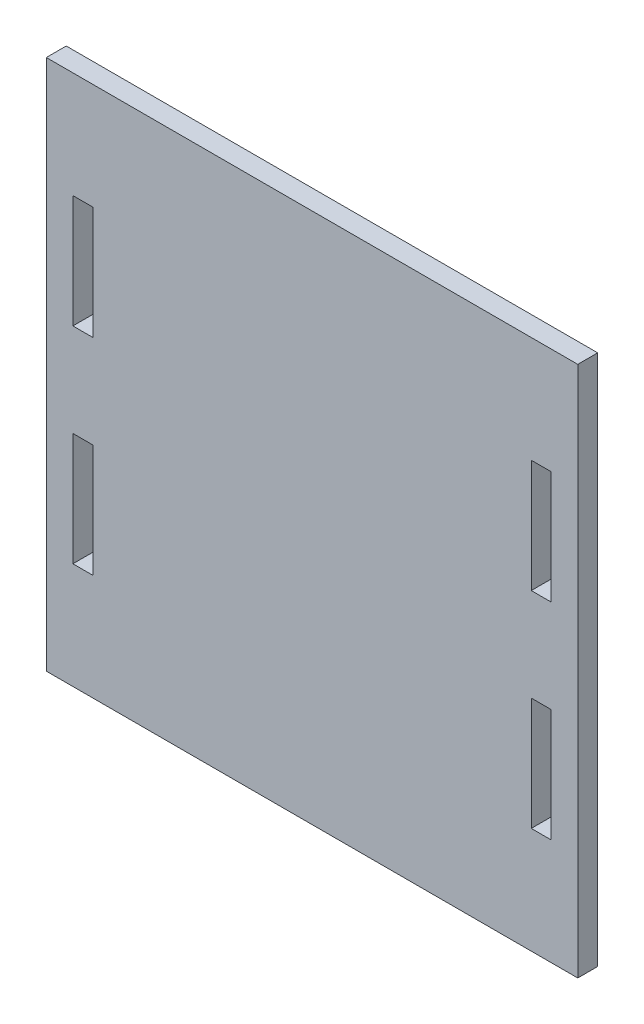
ISO-10303-21;
HEADER;
FILE_DESCRIPTION(('STEP AP214'),'2;1');
FILE_NAME('part.step','',(''),(''),'','','');
FILE_SCHEMA(('AUTOMOTIVE_DESIGN { 1 0 10303 214 1 1 1 1 }'));
ENDSEC;
DATA;
#1=APPLICATION_CONTEXT('core data for automotive mechanical design processes');
#2=APPLICATION_PROTOCOL_DEFINITION('international standard','automotive_design',2000,#1);
#3=PRODUCT_CONTEXT('',#1,'mechanical');
#4=PRODUCT('Part','Part','',(#3));
#5=PRODUCT_RELATED_PRODUCT_CATEGORY('part','',(#4));
#6=PRODUCT_DEFINITION_FORMATION('','',#4);
#7=PRODUCT_DEFINITION_CONTEXT('part definition',#1,'design');
#8=PRODUCT_DEFINITION('design','',#6,#7);
#9=PRODUCT_DEFINITION_SHAPE('','',#8);
#10=(LENGTH_UNIT() NAMED_UNIT(*) SI_UNIT(.MILLI.,.METRE.));
#11=(NAMED_UNIT(*) PLANE_ANGLE_UNIT() SI_UNIT($,.RADIAN.));
#12=(NAMED_UNIT(*) SI_UNIT($,.STERADIAN.) SOLID_ANGLE_UNIT());
#13=UNCERTAINTY_MEASURE_WITH_UNIT(LENGTH_MEASURE(1.E-05),#10,'distance_accuracy_value','');
#14=(GEOMETRIC_REPRESENTATION_CONTEXT(3) GLOBAL_UNCERTAINTY_ASSIGNED_CONTEXT((#13)) GLOBAL_UNIT_ASSIGNED_CONTEXT((#10,
#11,#12)) REPRESENTATION_CONTEXT('',''));
#15=CARTESIAN_POINT('',(0.,0.,0.));
#16=DIRECTION('',(0.,0.,1.));
#17=DIRECTION('',(1.,0.,0.));
#18=AXIS2_PLACEMENT_3D('',#15,#16,#17);
#19=CARTESIAN_POINT('',(0.,0.,4.7625));
#20=DIRECTION('',(0.,0.,-1.));
#21=DIRECTION('',(-1.,0.,0.));
#22=AXIS2_PLACEMENT_3D('',#19,#20,#21);
#23=PLANE('',#22);
#24=DIRECTION('',(0.,1.,0.));
#25=VECTOR('',#24,1.);
#26=CARTESIAN_POINT('',(120.65,40.9157375363102,4.7625));
#27=LINE('',#26,#25);
#28=CARTESIAN_POINT('',(120.65,40.9157375363102,4.7625));
#29=VERTEX_POINT('',#28);
#30=CARTESIAN_POINT('',(120.65,67.8905384245548,4.7625));
#31=VERTEX_POINT('',#30);
#32=EDGE_CURVE('E206',#29,#31,#27,.T.);
#33=ORIENTED_EDGE('',*,*,#32,.F.);
#34=DIRECTION('',(1.,0.,0.));
#35=VECTOR('',#34,1.);
#36=CARTESIAN_POINT('',(120.65,40.9157375363102,4.7625));
#37=LINE('',#36,#35);
#38=CARTESIAN_POINT('',(115.8875,40.9157375363102,4.7625));
#39=VERTEX_POINT('',#38);
#40=EDGE_CURVE('E214',#39,#29,#37,.T.);
#41=ORIENTED_EDGE('',*,*,#40,.F.);
#42=DIRECTION('',(0.,-1.,0.));
#43=VECTOR('',#42,1.);
#44=CARTESIAN_POINT('',(115.8875,40.9157375363102,4.7625));
#45=LINE('',#44,#43);
#46=CARTESIAN_POINT('',(115.8875,67.8905384245548,4.7625));
#47=VERTEX_POINT('',#46);
#48=EDGE_CURVE('E211',#47,#39,#45,.T.);
#49=ORIENTED_EDGE('',*,*,#48,.F.);
#50=DIRECTION('',(-1.,0.,0.));
#51=VECTOR('',#50,1.);
#52=CARTESIAN_POINT('',(120.65,67.8905384245548,4.7625));
#53=LINE('',#52,#51);
#54=EDGE_CURVE('E208',#31,#47,#53,.T.);
#55=ORIENTED_EDGE('',*,*,#54,.F.);
#56=EDGE_LOOP('',(#33,#41,#49,#55));
#57=FACE_BOUND('',#56,.T.);
#58=DIRECTION('',(0.,-1.,0.));
#59=VECTOR('',#58,1.);
#60=CARTESIAN_POINT('',(6.35000000000001,117.11573753631,4.7625));
#61=LINE('',#60,#59);
#62=CARTESIAN_POINT('',(6.35000000000001,117.11573753631,4.7625));
#63=VERTEX_POINT('',#62);
#64=CARTESIAN_POINT('',(6.35000000000001,90.1409366480657,4.7625));
#65=VERTEX_POINT('',#64);
#66=EDGE_CURVE('E268',#63,#65,#61,.T.);
#67=ORIENTED_EDGE('',*,*,#66,.F.);
#68=DIRECTION('',(-1.,0.,0.));
#69=VECTOR('',#68,1.);
#70=CARTESIAN_POINT('',(6.35000000000001,117.11573753631,4.7625));
#71=LINE('',#70,#69);
#72=CARTESIAN_POINT('',(11.1125,117.11573753631,4.7625));
#73=VERTEX_POINT('',#72);
#74=EDGE_CURVE('E276',#73,#63,#71,.T.);
#75=ORIENTED_EDGE('',*,*,#74,.F.);
#76=DIRECTION('',(0.,1.,0.));
#77=VECTOR('',#76,1.);
#78=CARTESIAN_POINT('',(11.1125,117.11573753631,4.7625));
#79=LINE('',#78,#77);
#80=CARTESIAN_POINT('',(11.1125,90.1409366480657,4.7625));
#81=VERTEX_POINT('',#80);
#82=EDGE_CURVE('E273',#81,#73,#79,.T.);
#83=ORIENTED_EDGE('',*,*,#82,.F.);
#84=DIRECTION('',(1.,0.,0.));
#85=VECTOR('',#84,1.);
#86=CARTESIAN_POINT('',(6.35000000000001,90.1409366480657,4.7625));
#87=LINE('',#86,#85);
#88=EDGE_CURVE('E270',#65,#81,#87,.T.);
#89=ORIENTED_EDGE('',*,*,#88,.F.);
#90=EDGE_LOOP('',(#67,#75,#83,#89));
#91=FACE_BOUND('',#90,.T.);
#92=DIRECTION('',(0.,-1.,0.));
#93=VECTOR('',#92,1.);
#94=CARTESIAN_POINT('',(0.,15.5157375363102,4.7625));
#95=LINE('',#94,#93);
#96=CARTESIAN_POINT('',(0.,142.51573753631,4.7625));
#97=VERTEX_POINT('',#96);
#98=CARTESIAN_POINT('',(0.,15.5157375363102,4.7625));
#99=VERTEX_POINT('',#98);
#100=EDGE_CURVE('E299',#97,#99,#95,.T.);
#101=ORIENTED_EDGE('',*,*,#100,.T.);
#102=DIRECTION('',(1.,0.,0.));
#103=VECTOR('',#102,1.);
#104=CARTESIAN_POINT('',(0.,15.5157375363102,4.7625));
#105=LINE('',#104,#103);
#106=CARTESIAN_POINT('',(127.,15.5157375363102,4.7625));
#107=VERTEX_POINT('',#106);
#108=EDGE_CURVE('E302',#99,#107,#105,.T.);
#109=ORIENTED_EDGE('',*,*,#108,.T.);
#110=DIRECTION('',(0.,1.,0.));
#111=VECTOR('',#110,1.);
#112=CARTESIAN_POINT('',(127.,15.5157375363102,4.7625));
#113=LINE('',#112,#111);
#114=CARTESIAN_POINT('',(127.,142.51573753631,4.7625));
#115=VERTEX_POINT('',#114);
#116=EDGE_CURVE('E305',#107,#115,#113,.T.);
#117=ORIENTED_EDGE('',*,*,#116,.T.);
#118=DIRECTION('',(-1.,0.,0.));
#119=VECTOR('',#118,1.);
#120=CARTESIAN_POINT('',(65.88125,142.51573753631,4.7625));
#121=LINE('',#120,#119);
#122=EDGE_CURVE('E307',#115,#97,#121,.T.);
#123=ORIENTED_EDGE('',*,*,#122,.T.);
#124=EDGE_LOOP('',(#101,#109,#117,#123));
#125=FACE_BOUND('',#124,.T.);
#126=DIRECTION('',(-1.,0.,0.));
#127=VECTOR('',#126,1.);
#128=CARTESIAN_POINT('',(120.65,117.11573753631,4.7625));
#129=LINE('',#128,#127);
#130=CARTESIAN_POINT('',(120.65,117.11573753631,4.7625));
#131=VERTEX_POINT('',#130);
#132=CARTESIAN_POINT('',(115.8875,117.11573753631,4.7625));
#133=VERTEX_POINT('',#132);
#134=EDGE_CURVE('E237',#131,#133,#129,.T.);
#135=ORIENTED_EDGE('',*,*,#134,.F.);
#136=DIRECTION('',(0.,1.,0.));
#137=VECTOR('',#136,1.);
#138=CARTESIAN_POINT('',(120.65,117.11573753631,4.7625));
#139=LINE('',#138,#137);
#140=CARTESIAN_POINT('',(120.65,90.1409366480657,4.7625));
#141=VERTEX_POINT('',#140);
#142=EDGE_CURVE('E245',#141,#131,#139,.T.);
#143=ORIENTED_EDGE('',*,*,#142,.F.);
#144=DIRECTION('',(1.,0.,0.));
#145=VECTOR('',#144,1.);
#146=CARTESIAN_POINT('',(120.65,90.1409366480657,4.7625));
#147=LINE('',#146,#145);
#148=CARTESIAN_POINT('',(115.8875,90.1409366480657,4.7625));
#149=VERTEX_POINT('',#148);
#150=EDGE_CURVE('E242',#149,#141,#147,.T.);
#151=ORIENTED_EDGE('',*,*,#150,.F.);
#152=DIRECTION('',(0.,-1.,0.));
#153=VECTOR('',#152,1.);
#154=CARTESIAN_POINT('',(115.8875,117.11573753631,4.7625));
#155=LINE('',#154,#153);
#156=EDGE_CURVE('E239',#133,#149,#155,.T.);
#157=ORIENTED_EDGE('',*,*,#156,.F.);
#158=EDGE_LOOP('',(#135,#143,#151,#157));
#159=FACE_BOUND('',#158,.T.);
#160=DIRECTION('',(1.,0.,0.));
#161=VECTOR('',#160,1.);
#162=CARTESIAN_POINT('',(6.35000000000001,40.9157375363102,4.7625));
#163=LINE('',#162,#161);
#164=CARTESIAN_POINT('',(6.35000000000001,40.9157375363102,4.7625));
#165=VERTEX_POINT('',#164);
#166=CARTESIAN_POINT('',(11.1125,40.9157375363102,4.7625));
#167=VERTEX_POINT('',#166);
#168=EDGE_CURVE('E170',#165,#167,#163,.T.);
#169=ORIENTED_EDGE('',*,*,#168,.F.);
#170=DIRECTION('',(0.,-1.,0.));
#171=VECTOR('',#170,1.);
#172=CARTESIAN_POINT('',(6.35000000000001,40.9157375363102,4.7625));
#173=LINE('',#172,#171);
#174=CARTESIAN_POINT('',(6.35000000000001,67.8905384245548,4.7625));
#175=VERTEX_POINT('',#174);
#176=EDGE_CURVE('E192',#175,#165,#173,.T.);
#177=ORIENTED_EDGE('',*,*,#176,.F.);
#178=DIRECTION('',(-1.,0.,0.));
#179=VECTOR('',#178,1.);
#180=CARTESIAN_POINT('',(6.35000000000001,67.8905384245548,4.7625));
#181=LINE('',#180,#179);
#182=CARTESIAN_POINT('',(11.1125,67.8905384245548,4.7625));
#183=VERTEX_POINT('',#182);
#184=EDGE_CURVE('E190',#183,#175,#181,.T.);
#185=ORIENTED_EDGE('',*,*,#184,.F.);
#186=DIRECTION('',(0.,1.,0.));
#187=VECTOR('',#186,1.);
#188=CARTESIAN_POINT('',(11.1125,40.9157375363102,4.7625));
#189=LINE('',#188,#187);
#190=EDGE_CURVE('E178',#167,#183,#189,.T.);
#191=ORIENTED_EDGE('',*,*,#190,.F.);
#192=EDGE_LOOP('',(#169,#177,#185,#191));
#193=FACE_BOUND('',#192,.T.);
#194=ADVANCED_FACE('F33',(#57,#91,#125,#159,#193),#23,.F.);
#195=CARTESIAN_POINT('',(0.,0.,0.));
#196=DIRECTION('',(0.,0.,-1.));
#197=DIRECTION('',(-1.,0.,0.));
#198=AXIS2_PLACEMENT_3D('',#195,#196,#197);
#199=PLANE('',#198);
#200=DIRECTION('',(1.,0.,0.));
#201=VECTOR('',#200,1.);
#202=CARTESIAN_POINT('',(120.65,40.9157375363102,0.));
#203=LINE('',#202,#201);
#204=CARTESIAN_POINT('',(115.8875,40.9157375363102,0.));
#205=VERTEX_POINT('',#204);
#206=CARTESIAN_POINT('',(120.65,40.9157375363102,0.));
#207=VERTEX_POINT('',#206);
#208=EDGE_CURVE('E209',#205,#207,#203,.T.);
#209=ORIENTED_EDGE('',*,*,#208,.T.);
#210=DIRECTION('',(0.,1.,0.));
#211=VECTOR('',#210,1.);
#212=CARTESIAN_POINT('',(120.65,40.9157375363102,0.));
#213=LINE('',#212,#211);
#214=CARTESIAN_POINT('',(120.65,67.8905384245548,0.));
#215=VERTEX_POINT('',#214);
#216=EDGE_CURVE('E186',#207,#215,#213,.T.);
#217=ORIENTED_EDGE('',*,*,#216,.T.);
#218=DIRECTION('',(-1.,0.,0.));
#219=VECTOR('',#218,1.);
#220=CARTESIAN_POINT('',(120.65,67.8905384245548,0.));
#221=LINE('',#220,#219);
#222=CARTESIAN_POINT('',(115.8875,67.8905384245548,0.));
#223=VERTEX_POINT('',#222);
#224=EDGE_CURVE('E219',#215,#223,#221,.T.);
#225=ORIENTED_EDGE('',*,*,#224,.T.);
#226=DIRECTION('',(0.,-1.,0.));
#227=VECTOR('',#226,1.);
#228=CARTESIAN_POINT('',(115.8875,40.9157375363102,0.));
#229=LINE('',#228,#227);
#230=EDGE_CURVE('E222',#223,#205,#229,.T.);
#231=ORIENTED_EDGE('',*,*,#230,.T.);
#232=EDGE_LOOP('',(#209,#217,#225,#231));
#233=FACE_BOUND('',#232,.T.);
#234=DIRECTION('',(-1.,0.,0.));
#235=VECTOR('',#234,1.);
#236=CARTESIAN_POINT('',(6.35000000000001,117.11573753631,0.));
#237=LINE('',#236,#235);
#238=CARTESIAN_POINT('',(11.1125,117.11573753631,0.));
#239=VERTEX_POINT('',#238);
#240=CARTESIAN_POINT('',(6.35000000000001,117.11573753631,0.));
#241=VERTEX_POINT('',#240);
#242=EDGE_CURVE('E271',#239,#241,#237,.T.);
#243=ORIENTED_EDGE('',*,*,#242,.T.);
#244=DIRECTION('',(0.,-1.,0.));
#245=VECTOR('',#244,1.);
#246=CARTESIAN_POINT('',(6.35000000000001,117.11573753631,0.));
#247=LINE('',#246,#245);
#248=CARTESIAN_POINT('',(6.35000000000001,90.1409366480657,0.));
#249=VERTEX_POINT('',#248);
#250=EDGE_CURVE('E267',#241,#249,#247,.T.);
#251=ORIENTED_EDGE('',*,*,#250,.T.);
#252=DIRECTION('',(1.,0.,0.));
#253=VECTOR('',#252,1.);
#254=CARTESIAN_POINT('',(6.35000000000001,90.1409366480657,0.));
#255=LINE('',#254,#253);
#256=CARTESIAN_POINT('',(11.1125,90.1409366480657,0.));
#257=VERTEX_POINT('',#256);
#258=EDGE_CURVE('E281',#249,#257,#255,.T.);
#259=ORIENTED_EDGE('',*,*,#258,.T.);
#260=DIRECTION('',(0.,1.,0.));
#261=VECTOR('',#260,1.);
#262=CARTESIAN_POINT('',(11.1125,117.11573753631,0.));
#263=LINE('',#262,#261);
#264=EDGE_CURVE('E284',#257,#239,#263,.T.);
#265=ORIENTED_EDGE('',*,*,#264,.T.);
#266=EDGE_LOOP('',(#243,#251,#259,#265));
#267=FACE_BOUND('',#266,.T.);
#268=DIRECTION('',(0.,-1.,0.));
#269=VECTOR('',#268,1.);
#270=CARTESIAN_POINT('',(0.,15.5157375363102,0.));
#271=LINE('',#270,#269);
#272=CARTESIAN_POINT('',(0.,142.51573753631,0.));
#273=VERTEX_POINT('',#272);
#274=CARTESIAN_POINT('',(0.,15.5157375363102,0.));
#275=VERTEX_POINT('',#274);
#276=EDGE_CURVE('E298',#273,#275,#271,.T.);
#277=ORIENTED_EDGE('',*,*,#276,.F.);
#278=DIRECTION('',(-1.,0.,0.));
#279=VECTOR('',#278,1.);
#280=CARTESIAN_POINT('',(0.,142.51573753631,0.));
#281=LINE('',#280,#279);
#282=CARTESIAN_POINT('',(127.,142.51573753631,0.));
#283=VERTEX_POINT('',#282);
#284=EDGE_CURVE('E303',#283,#273,#281,.T.);
#285=ORIENTED_EDGE('',*,*,#284,.F.);
#286=DIRECTION('',(0.,1.,0.));
#287=VECTOR('',#286,1.);
#288=CARTESIAN_POINT('',(127.,15.5157375363102,0.));
#289=LINE('',#288,#287);
#290=CARTESIAN_POINT('',(127.,15.5157375363102,0.));
#291=VERTEX_POINT('',#290);
#292=EDGE_CURVE('E314',#291,#283,#289,.T.);
#293=ORIENTED_EDGE('',*,*,#292,.F.);
#294=DIRECTION('',(1.,0.,0.));
#295=VECTOR('',#294,1.);
#296=CARTESIAN_POINT('',(0.,15.5157375363102,0.));
#297=LINE('',#296,#295);
#298=EDGE_CURVE('E312',#275,#291,#297,.T.);
#299=ORIENTED_EDGE('',*,*,#298,.F.);
#300=EDGE_LOOP('',(#277,#285,#293,#299));
#301=FACE_BOUND('',#300,.T.);
#302=DIRECTION('',(0.,1.,0.));
#303=VECTOR('',#302,1.);
#304=CARTESIAN_POINT('',(120.65,117.11573753631,0.));
#305=LINE('',#304,#303);
#306=CARTESIAN_POINT('',(120.65,90.1409366480657,0.));
#307=VERTEX_POINT('',#306);
#308=CARTESIAN_POINT('',(120.65,117.11573753631,0.));
#309=VERTEX_POINT('',#308);
#310=EDGE_CURVE('E240',#307,#309,#305,.T.);
#311=ORIENTED_EDGE('',*,*,#310,.T.);
#312=DIRECTION('',(-1.,0.,0.));
#313=VECTOR('',#312,1.);
#314=CARTESIAN_POINT('',(120.65,117.11573753631,0.));
#315=LINE('',#314,#313);
#316=CARTESIAN_POINT('',(115.8875,117.11573753631,0.));
#317=VERTEX_POINT('',#316);
#318=EDGE_CURVE('E236',#309,#317,#315,.T.);
#319=ORIENTED_EDGE('',*,*,#318,.T.);
#320=DIRECTION('',(0.,-1.,0.));
#321=VECTOR('',#320,1.);
#322=CARTESIAN_POINT('',(115.8875,117.11573753631,0.));
#323=LINE('',#322,#321);
#324=CARTESIAN_POINT('',(115.8875,90.1409366480657,0.));
#325=VERTEX_POINT('',#324);
#326=EDGE_CURVE('E250',#317,#325,#323,.T.);
#327=ORIENTED_EDGE('',*,*,#326,.T.);
#328=DIRECTION('',(1.,0.,0.));
#329=VECTOR('',#328,1.);
#330=CARTESIAN_POINT('',(120.65,90.1409366480657,0.));
#331=LINE('',#330,#329);
#332=EDGE_CURVE('E253',#325,#307,#331,.T.);
#333=ORIENTED_EDGE('',*,*,#332,.T.);
#334=EDGE_LOOP('',(#311,#319,#327,#333));
#335=FACE_BOUND('',#334,.T.);
#336=DIRECTION('',(0.,-1.,0.));
#337=VECTOR('',#336,1.);
#338=CARTESIAN_POINT('',(6.35000000000001,40.9157375363102,0.));
#339=LINE('',#338,#337);
#340=CARTESIAN_POINT('',(6.35000000000001,67.8905384245548,0.));
#341=VERTEX_POINT('',#340);
#342=CARTESIAN_POINT('',(6.35000000000001,40.9157375363102,0.));
#343=VERTEX_POINT('',#342);
#344=EDGE_CURVE('E179',#341,#343,#339,.T.);
#345=ORIENTED_EDGE('',*,*,#344,.T.);
#346=DIRECTION('',(1.,0.,0.));
#347=VECTOR('',#346,1.);
#348=CARTESIAN_POINT('',(6.35000000000001,40.9157375363102,0.));
#349=LINE('',#348,#347);
#350=CARTESIAN_POINT('',(11.1125,40.9157375363102,0.));
#351=VERTEX_POINT('',#350);
#352=EDGE_CURVE('E56',#343,#351,#349,.T.);
#353=ORIENTED_EDGE('',*,*,#352,.T.);
#354=DIRECTION('',(0.,1.,0.));
#355=VECTOR('',#354,1.);
#356=CARTESIAN_POINT('',(11.1125,40.9157375363102,0.));
#357=LINE('',#356,#355);
#358=CARTESIAN_POINT('',(11.1125,67.8905384245548,0.));
#359=VERTEX_POINT('',#358);
#360=EDGE_CURVE('E185',#351,#359,#357,.T.);
#361=ORIENTED_EDGE('',*,*,#360,.T.);
#362=DIRECTION('',(-1.,0.,0.));
#363=VECTOR('',#362,1.);
#364=CARTESIAN_POINT('',(6.35000000000001,67.8905384245548,0.));
#365=LINE('',#364,#363);
#366=EDGE_CURVE('E198',#359,#341,#365,.T.);
#367=ORIENTED_EDGE('',*,*,#366,.T.);
#368=EDGE_LOOP('',(#345,#353,#361,#367));
#369=FACE_BOUND('',#368,.T.);
#370=ADVANCED_FACE('F332',(#233,#267,#301,#335,#369),#199,.T.);
#371=CARTESIAN_POINT('',(0.,15.5157375363102,4.7625));
#372=DIRECTION('',(1.,0.,0.));
#373=DIRECTION('',(0.,0.,-1.));
#374=AXIS2_PLACEMENT_3D('',#371,#372,#373);
#375=PLANE('',#374);
#376=ORIENTED_EDGE('',*,*,#276,.T.);
#377=DIRECTION('',(0.,0.,-1.));
#378=VECTOR('',#377,1.);
#379=CARTESIAN_POINT('',(0.,15.5157375363102,4.7625));
#380=LINE('',#379,#378);
#381=EDGE_CURVE('E11',#99,#275,#380,.T.);
#382=ORIENTED_EDGE('',*,*,#381,.F.);
#383=ORIENTED_EDGE('',*,*,#100,.F.);
#384=DIRECTION('',(0.,0.,-1.));
#385=VECTOR('',#384,1.);
#386=CARTESIAN_POINT('',(0.,142.51573753631,4.7625));
#387=LINE('',#386,#385);
#388=EDGE_CURVE('E309',#97,#273,#387,.T.);
#389=ORIENTED_EDGE('',*,*,#388,.T.);
#390=EDGE_LOOP('',(#376,#382,#383,#389));
#391=FACE_BOUND('',#390,.T.);
#392=ADVANCED_FACE('F35',(#391),#375,.F.);
#393=CARTESIAN_POINT('',(0.,15.5157375363102,4.7625));
#394=DIRECTION('',(0.,1.,0.));
#395=DIRECTION('',(0.,0.,1.));
#396=AXIS2_PLACEMENT_3D('',#393,#394,#395);
#397=PLANE('',#396);
#398=ORIENTED_EDGE('',*,*,#298,.T.);
#399=DIRECTION('',(0.,0.,-1.));
#400=VECTOR('',#399,1.);
#401=CARTESIAN_POINT('',(127.,15.5157375363102,4.7625));
#402=LINE('',#401,#400);
#403=EDGE_CURVE('E41',#107,#291,#402,.T.);
#404=ORIENTED_EDGE('',*,*,#403,.F.);
#405=ORIENTED_EDGE('',*,*,#108,.F.);
#406=ORIENTED_EDGE('',*,*,#381,.T.);
#407=EDGE_LOOP('',(#398,#404,#405,#406));
#408=FACE_BOUND('',#407,.T.);
#409=ADVANCED_FACE('F343',(#408),#397,.F.);
#410=CARTESIAN_POINT('',(127.,15.5157375363102,4.7625));
#411=DIRECTION('',(-1.,0.,0.));
#412=DIRECTION('',(0.,0.,1.));
#413=AXIS2_PLACEMENT_3D('',#410,#411,#412);
#414=PLANE('',#413);
#415=ORIENTED_EDGE('',*,*,#292,.T.);
#416=DIRECTION('',(0.,0.,-1.));
#417=VECTOR('',#416,1.);
#418=CARTESIAN_POINT('',(127.,142.51573753631,4.7625));
#419=LINE('',#418,#417);
#420=EDGE_CURVE('E320',#115,#283,#419,.T.);
#421=ORIENTED_EDGE('',*,*,#420,.F.);
#422=ORIENTED_EDGE('',*,*,#116,.F.);
#423=ORIENTED_EDGE('',*,*,#403,.T.);
#424=EDGE_LOOP('',(#415,#421,#422,#423));
#425=FACE_BOUND('',#424,.T.);
#426=ADVANCED_FACE('F327',(#425),#414,.F.);
#427=CARTESIAN_POINT('',(0.,142.51573753631,4.7625));
#428=DIRECTION('',(0.,-1.,0.));
#429=DIRECTION('',(0.,0.,-1.));
#430=AXIS2_PLACEMENT_3D('',#427,#428,#429);
#431=PLANE('',#430);
#432=ORIENTED_EDGE('',*,*,#284,.T.);
#433=ORIENTED_EDGE('',*,*,#388,.F.);
#434=ORIENTED_EDGE('',*,*,#122,.F.);
#435=ORIENTED_EDGE('',*,*,#420,.T.);
#436=EDGE_LOOP('',(#432,#433,#434,#435));
#437=FACE_BOUND('',#436,.T.);
#438=ADVANCED_FACE('F336',(#437),#431,.F.);
#439=CARTESIAN_POINT('',(6.35000000000001,117.11573753631,4.7625));
#440=DIRECTION('',(1.,0.,0.));
#441=DIRECTION('',(0.,1.,0.));
#442=AXIS2_PLACEMENT_3D('',#439,#440,#441);
#443=PLANE('',#442);
#444=ORIENTED_EDGE('',*,*,#250,.F.);
#445=DIRECTION('',(0.,0.,-1.));
#446=VECTOR('',#445,1.);
#447=CARTESIAN_POINT('',(6.35000000000001,117.11573753631,4.7625));
#448=LINE('',#447,#446);
#449=EDGE_CURVE('E278',#63,#241,#448,.T.);
#450=ORIENTED_EDGE('',*,*,#449,.F.);
#451=ORIENTED_EDGE('',*,*,#66,.T.);
#452=DIRECTION('',(0.,0.,-1.));
#453=VECTOR('',#452,1.);
#454=CARTESIAN_POINT('',(6.35000000000001,90.1409366480657,4.7625));
#455=LINE('',#454,#453);
#456=EDGE_CURVE('E295',#65,#249,#455,.T.);
#457=ORIENTED_EDGE('',*,*,#456,.T.);
#458=EDGE_LOOP('',(#444,#450,#451,#457));
#459=FACE_BOUND('',#458,.T.);
#460=ADVANCED_FACE('F361',(#459),#443,.T.);
#461=CARTESIAN_POINT('',(6.35000000000001,90.1409366480657,4.7625));
#462=DIRECTION('',(0.,1.,0.));
#463=DIRECTION('',(0.,0.,1.));
#464=AXIS2_PLACEMENT_3D('',#461,#462,#463);
#465=PLANE('',#464);
#466=ORIENTED_EDGE('',*,*,#258,.F.);
#467=ORIENTED_EDGE('',*,*,#456,.F.);
#468=ORIENTED_EDGE('',*,*,#88,.T.);
#469=DIRECTION('',(0.,0.,-1.));
#470=VECTOR('',#469,1.);
#471=CARTESIAN_POINT('',(11.1125,90.1409366480657,4.7625));
#472=LINE('',#471,#470);
#473=EDGE_CURVE('E293',#81,#257,#472,.T.);
#474=ORIENTED_EDGE('',*,*,#473,.T.);
#475=EDGE_LOOP('',(#466,#467,#468,#474));
#476=FACE_BOUND('',#475,.T.);
#477=ADVANCED_FACE('F368',(#476),#465,.T.);
#478=CARTESIAN_POINT('',(11.1125,117.11573753631,4.7625));
#479=DIRECTION('',(-1.,0.,0.));
#480=DIRECTION('',(0.,-1.,0.));
#481=AXIS2_PLACEMENT_3D('',#478,#479,#480);
#482=PLANE('',#481);
#483=ORIENTED_EDGE('',*,*,#264,.F.);
#484=ORIENTED_EDGE('',*,*,#473,.F.);
#485=ORIENTED_EDGE('',*,*,#82,.T.);
#486=DIRECTION('',(0.,0.,-1.));
#487=VECTOR('',#486,1.);
#488=CARTESIAN_POINT('',(11.1125,117.11573753631,4.7625));
#489=LINE('',#488,#487);
#490=EDGE_CURVE('E291',#73,#239,#489,.T.);
#491=ORIENTED_EDGE('',*,*,#490,.T.);
#492=EDGE_LOOP('',(#483,#484,#485,#491));
#493=FACE_BOUND('',#492,.T.);
#494=ADVANCED_FACE('F373',(#493),#482,.T.);
#495=CARTESIAN_POINT('',(6.35000000000001,117.11573753631,4.7625));
#496=DIRECTION('',(0.,-1.,0.));
#497=DIRECTION('',(0.,0.,-1.));
#498=AXIS2_PLACEMENT_3D('',#495,#496,#497);
#499=PLANE('',#498);
#500=ORIENTED_EDGE('',*,*,#242,.F.);
#501=ORIENTED_EDGE('',*,*,#490,.F.);
#502=ORIENTED_EDGE('',*,*,#74,.T.);
#503=ORIENTED_EDGE('',*,*,#449,.T.);
#504=EDGE_LOOP('',(#500,#501,#502,#503));
#505=FACE_BOUND('',#504,.T.);
#506=ADVANCED_FACE('F381',(#505),#499,.T.);
#507=CARTESIAN_POINT('',(120.65,117.11573753631,4.7625));
#508=DIRECTION('',(0.,-1.,0.));
#509=DIRECTION('',(0.,0.,-1.));
#510=AXIS2_PLACEMENT_3D('',#507,#508,#509);
#511=PLANE('',#510);
#512=ORIENTED_EDGE('',*,*,#318,.F.);
#513=DIRECTION('',(0.,0.,-1.));
#514=VECTOR('',#513,1.);
#515=CARTESIAN_POINT('',(120.65,117.11573753631,4.7625));
#516=LINE('',#515,#514);
#517=EDGE_CURVE('E247',#131,#309,#516,.T.);
#518=ORIENTED_EDGE('',*,*,#517,.F.);
#519=ORIENTED_EDGE('',*,*,#134,.T.);
#520=DIRECTION('',(0.,0.,-1.));
#521=VECTOR('',#520,1.);
#522=CARTESIAN_POINT('',(115.8875,117.11573753631,4.7625));
#523=LINE('',#522,#521);
#524=EDGE_CURVE('E264',#133,#317,#523,.T.);
#525=ORIENTED_EDGE('',*,*,#524,.T.);
#526=EDGE_LOOP('',(#512,#518,#519,#525));
#527=FACE_BOUND('',#526,.T.);
#528=ADVANCED_FACE('F393',(#527),#511,.T.);
#529=CARTESIAN_POINT('',(115.8875,117.11573753631,4.7625));
#530=DIRECTION('',(1.,0.,0.));
#531=DIRECTION('',(0.,0.,-1.));
#532=AXIS2_PLACEMENT_3D('',#529,#530,#531);
#533=PLANE('',#532);
#534=ORIENTED_EDGE('',*,*,#326,.F.);
#535=ORIENTED_EDGE('',*,*,#524,.F.);
#536=ORIENTED_EDGE('',*,*,#156,.T.);
#537=DIRECTION('',(0.,0.,-1.));
#538=VECTOR('',#537,1.);
#539=CARTESIAN_POINT('',(115.8875,90.1409366480657,4.7625));
#540=LINE('',#539,#538);
#541=EDGE_CURVE('E262',#149,#325,#540,.T.);
#542=ORIENTED_EDGE('',*,*,#541,.T.);
#543=EDGE_LOOP('',(#534,#535,#536,#542));
#544=FACE_BOUND('',#543,.T.);
#545=ADVANCED_FACE('F398',(#544),#533,.T.);
#546=CARTESIAN_POINT('',(120.65,90.1409366480657,4.7625));
#547=DIRECTION('',(0.,1.,0.));
#548=DIRECTION('',(0.,0.,1.));
#549=AXIS2_PLACEMENT_3D('',#546,#547,#548);
#550=PLANE('',#549);
#551=ORIENTED_EDGE('',*,*,#332,.F.);
#552=ORIENTED_EDGE('',*,*,#541,.F.);
#553=ORIENTED_EDGE('',*,*,#150,.T.);
#554=DIRECTION('',(0.,0.,-1.));
#555=VECTOR('',#554,1.);
#556=CARTESIAN_POINT('',(120.65,90.1409366480657,4.7625));
#557=LINE('',#556,#555);
#558=EDGE_CURVE('E260',#141,#307,#557,.T.);
#559=ORIENTED_EDGE('',*,*,#558,.T.);
#560=EDGE_LOOP('',(#551,#552,#553,#559));
#561=FACE_BOUND('',#560,.T.);
#562=ADVANCED_FACE('F402',(#561),#550,.T.);
#563=CARTESIAN_POINT('',(120.65,117.11573753631,4.7625));
#564=DIRECTION('',(-1.,0.,0.));
#565=DIRECTION('',(0.,0.,1.));
#566=AXIS2_PLACEMENT_3D('',#563,#564,#565);
#567=PLANE('',#566);
#568=ORIENTED_EDGE('',*,*,#310,.F.);
#569=ORIENTED_EDGE('',*,*,#558,.F.);
#570=ORIENTED_EDGE('',*,*,#142,.T.);
#571=ORIENTED_EDGE('',*,*,#517,.T.);
#572=EDGE_LOOP('',(#568,#569,#570,#571));
#573=FACE_BOUND('',#572,.T.);
#574=ADVANCED_FACE('F406',(#573),#567,.T.);
#575=CARTESIAN_POINT('',(120.65,40.9157375363102,4.7625));
#576=DIRECTION('',(-1.,0.,0.));
#577=DIRECTION('',(0.,0.,1.));
#578=AXIS2_PLACEMENT_3D('',#575,#576,#577);
#579=PLANE('',#578);
#580=ORIENTED_EDGE('',*,*,#216,.F.);
#581=DIRECTION('',(0.,0.,-1.));
#582=VECTOR('',#581,1.);
#583=CARTESIAN_POINT('',(120.65,40.9157375363102,4.7625));
#584=LINE('',#583,#582);
#585=EDGE_CURVE('E216',#29,#207,#584,.T.);
#586=ORIENTED_EDGE('',*,*,#585,.F.);
#587=ORIENTED_EDGE('',*,*,#32,.T.);
#588=DIRECTION('',(0.,0.,-1.));
#589=VECTOR('',#588,1.);
#590=CARTESIAN_POINT('',(120.65,67.8905384245548,4.7625));
#591=LINE('',#590,#589);
#592=EDGE_CURVE('E233',#31,#215,#591,.T.);
#593=ORIENTED_EDGE('',*,*,#592,.T.);
#594=EDGE_LOOP('',(#580,#586,#587,#593));
#595=FACE_BOUND('',#594,.T.);
#596=ADVANCED_FACE('F410',(#595),#579,.T.);
#597=CARTESIAN_POINT('',(120.65,67.8905384245548,4.7625));
#598=DIRECTION('',(0.,-1.,0.));
#599=DIRECTION('',(0.,0.,-1.));
#600=AXIS2_PLACEMENT_3D('',#597,#598,#599);
#601=PLANE('',#600);
#602=ORIENTED_EDGE('',*,*,#224,.F.);
#603=ORIENTED_EDGE('',*,*,#592,.F.);
#604=ORIENTED_EDGE('',*,*,#54,.T.);
#605=DIRECTION('',(0.,0.,-1.));
#606=VECTOR('',#605,1.);
#607=CARTESIAN_POINT('',(115.8875,67.8905384245548,4.7625));
#608=LINE('',#607,#606);
#609=EDGE_CURVE('E231',#47,#223,#608,.T.);
#610=ORIENTED_EDGE('',*,*,#609,.T.);
#611=EDGE_LOOP('',(#602,#603,#604,#610));
#612=FACE_BOUND('',#611,.T.);
#613=ADVANCED_FACE('F414',(#612),#601,.T.);
#614=CARTESIAN_POINT('',(115.8875,40.9157375363102,4.7625));
#615=DIRECTION('',(1.,0.,0.));
#616=DIRECTION('',(0.,0.,-1.));
#617=AXIS2_PLACEMENT_3D('',#614,#615,#616);
#618=PLANE('',#617);
#619=ORIENTED_EDGE('',*,*,#230,.F.);
#620=ORIENTED_EDGE('',*,*,#609,.F.);
#621=ORIENTED_EDGE('',*,*,#48,.T.);
#622=DIRECTION('',(0.,0.,-1.));
#623=VECTOR('',#622,1.);
#624=CARTESIAN_POINT('',(115.8875,40.9157375363102,4.7625));
#625=LINE('',#624,#623);
#626=EDGE_CURVE('E229',#39,#205,#625,.T.);
#627=ORIENTED_EDGE('',*,*,#626,.T.);
#628=EDGE_LOOP('',(#619,#620,#621,#627));
#629=FACE_BOUND('',#628,.T.);
#630=ADVANCED_FACE('F418',(#629),#618,.T.);
#631=CARTESIAN_POINT('',(120.65,40.9157375363102,4.7625));
#632=DIRECTION('',(0.,1.,0.));
#633=DIRECTION('',(0.,0.,1.));
#634=AXIS2_PLACEMENT_3D('',#631,#632,#633);
#635=PLANE('',#634);
#636=ORIENTED_EDGE('',*,*,#208,.F.);
#637=ORIENTED_EDGE('',*,*,#626,.F.);
#638=ORIENTED_EDGE('',*,*,#40,.T.);
#639=ORIENTED_EDGE('',*,*,#585,.T.);
#640=EDGE_LOOP('',(#636,#637,#638,#639));
#641=FACE_BOUND('',#640,.T.);
#642=ADVANCED_FACE('F422',(#641),#635,.T.);
#643=CARTESIAN_POINT('',(6.35000000000001,40.9157375363102,4.7625));
#644=DIRECTION('',(0.,1.,0.));
#645=DIRECTION('',(0.,0.,1.));
#646=AXIS2_PLACEMENT_3D('',#643,#644,#645);
#647=PLANE('',#646);
#648=ORIENTED_EDGE('',*,*,#352,.F.);
#649=DIRECTION('',(0.,0.,-1.));
#650=VECTOR('',#649,1.);
#651=CARTESIAN_POINT('',(6.35000000000001,40.9157375363102,4.7625));
#652=LINE('',#651,#650);
#653=EDGE_CURVE('E174',#165,#343,#652,.T.);
#654=ORIENTED_EDGE('',*,*,#653,.F.);
#655=ORIENTED_EDGE('',*,*,#168,.T.);
#656=DIRECTION('',(0.,0.,-1.));
#657=VECTOR('',#656,1.);
#658=CARTESIAN_POINT('',(11.1125,40.9157375363102,4.7625));
#659=LINE('',#658,#657);
#660=EDGE_CURVE('E173',#167,#351,#659,.T.);
#661=ORIENTED_EDGE('',*,*,#660,.T.);
#662=EDGE_LOOP('',(#648,#654,#655,#661));
#663=FACE_BOUND('',#662,.T.);
#664=ADVANCED_FACE('F172',(#663),#647,.T.);
#665=CARTESIAN_POINT('',(11.1125,40.9157375363102,4.7625));
#666=DIRECTION('',(-1.,0.,0.));
#667=DIRECTION('',(0.,-1.,0.));
#668=AXIS2_PLACEMENT_3D('',#665,#666,#667);
#669=PLANE('',#668);
#670=ORIENTED_EDGE('',*,*,#360,.F.);
#671=ORIENTED_EDGE('',*,*,#660,.F.);
#672=ORIENTED_EDGE('',*,*,#190,.T.);
#673=DIRECTION('',(0.,0.,-1.));
#674=VECTOR('',#673,1.);
#675=CARTESIAN_POINT('',(11.1125,67.8905384245548,4.7625));
#676=LINE('',#675,#674);
#677=EDGE_CURVE('E187',#183,#359,#676,.T.);
#678=ORIENTED_EDGE('',*,*,#677,.T.);
#679=EDGE_LOOP('',(#670,#671,#672,#678));
#680=FACE_BOUND('',#679,.T.);
#681=ADVANCED_FACE('F182',(#680),#669,.T.);
#682=CARTESIAN_POINT('',(6.35000000000001,67.8905384245548,4.7625));
#683=DIRECTION('',(0.,-1.,0.));
#684=DIRECTION('',(0.,0.,-1.));
#685=AXIS2_PLACEMENT_3D('',#682,#683,#684);
#686=PLANE('',#685);
#687=ORIENTED_EDGE('',*,*,#366,.F.);
#688=ORIENTED_EDGE('',*,*,#677,.F.);
#689=ORIENTED_EDGE('',*,*,#184,.T.);
#690=DIRECTION('',(0.,0.,-1.));
#691=VECTOR('',#690,1.);
#692=CARTESIAN_POINT('',(6.35000000000001,67.8905384245548,4.7625));
#693=LINE('',#692,#691);
#694=EDGE_CURVE('E48',#175,#341,#693,.T.);
#695=ORIENTED_EDGE('',*,*,#694,.T.);
#696=EDGE_LOOP('',(#687,#688,#689,#695));
#697=FACE_BOUND('',#696,.T.);
#698=ADVANCED_FACE('F431',(#697),#686,.T.);
#699=CARTESIAN_POINT('',(6.35000000000001,40.9157375363102,4.7625));
#700=DIRECTION('',(1.,0.,0.));
#701=DIRECTION('',(0.,1.,0.));
#702=AXIS2_PLACEMENT_3D('',#699,#700,#701);
#703=PLANE('',#702);
#704=ORIENTED_EDGE('',*,*,#344,.F.);
#705=ORIENTED_EDGE('',*,*,#694,.F.);
#706=ORIENTED_EDGE('',*,*,#176,.T.);
#707=ORIENTED_EDGE('',*,*,#653,.T.);
#708=EDGE_LOOP('',(#704,#705,#706,#707));
#709=FACE_BOUND('',#708,.T.);
#710=ADVANCED_FACE('F434',(#709),#703,.T.);
#711=CLOSED_SHELL('',(#194,#370,#392,#409,#426,#438,#460,#477,#494,#506,#528,#545,#562,#574,
#596,#613,#630,#642,#664,#681,#698,#710));
#712=MANIFOLD_SOLID_BREP('B2',#711);
#713=ADVANCED_BREP_SHAPE_REPRESENTATION('',(#18,#712),#14);
#714=SHAPE_DEFINITION_REPRESENTATION(#9,#713);
ENDSEC;
END-ISO-10303-21;
